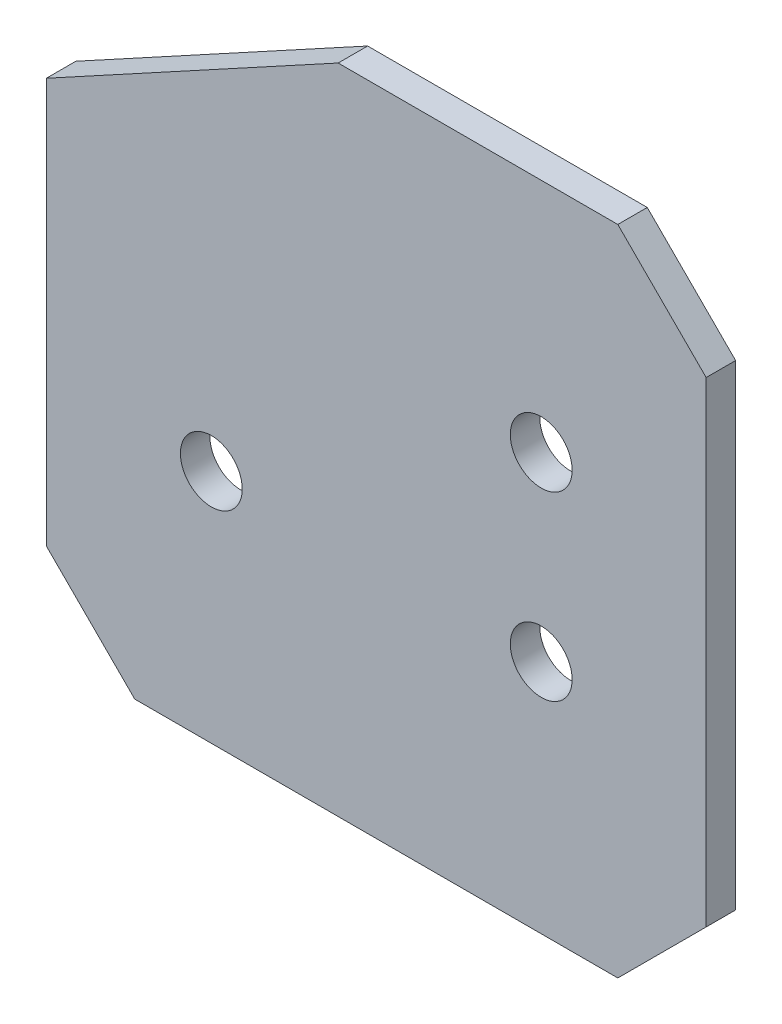
ISO-10303-21;
HEADER;
FILE_DESCRIPTION(('STEP AP214'),'2;1');
FILE_NAME('part.step','',(''),(''),'','','');
FILE_SCHEMA(('AUTOMOTIVE_DESIGN { 1 0 10303 214 1 1 1 1 }'));
ENDSEC;
DATA;
#1=APPLICATION_CONTEXT('core data for automotive mechanical design processes');
#2=APPLICATION_PROTOCOL_DEFINITION('international standard','automotive_design',2000,#1);
#3=PRODUCT_CONTEXT('',#1,'mechanical');
#4=PRODUCT('Part','Part','',(#3));
#5=PRODUCT_RELATED_PRODUCT_CATEGORY('part','',(#4));
#6=PRODUCT_DEFINITION_FORMATION('','',#4);
#7=PRODUCT_DEFINITION_CONTEXT('part definition',#1,'design');
#8=PRODUCT_DEFINITION('design','',#6,#7);
#9=PRODUCT_DEFINITION_SHAPE('','',#8);
#10=(LENGTH_UNIT() NAMED_UNIT(*) SI_UNIT(.MILLI.,.METRE.));
#11=(NAMED_UNIT(*) PLANE_ANGLE_UNIT() SI_UNIT($,.RADIAN.));
#12=(NAMED_UNIT(*) SI_UNIT($,.STERADIAN.) SOLID_ANGLE_UNIT());
#13=UNCERTAINTY_MEASURE_WITH_UNIT(LENGTH_MEASURE(1.E-05),#10,'distance_accuracy_value','');
#14=(GEOMETRIC_REPRESENTATION_CONTEXT(3) GLOBAL_UNCERTAINTY_ASSIGNED_CONTEXT((#13)) GLOBAL_UNIT_ASSIGNED_CONTEXT((#10,
#11,#12)) REPRESENTATION_CONTEXT('',''));
#15=CARTESIAN_POINT('',(0.,0.,0.));
#16=DIRECTION('',(0.,0.,1.));
#17=DIRECTION('',(1.,0.,0.));
#18=AXIS2_PLACEMENT_3D('',#15,#16,#17);
#19=CARTESIAN_POINT('',(55.9999999999994,3.00000000000045,-5.));
#20=DIRECTION('',(1.,0.,0.));
#21=DIRECTION('',(0.,1.,0.));
#22=AXIS2_PLACEMENT_3D('',#19,#20,#21);
#23=PLANE('',#22);
#24=DIRECTION('',(0.,1.,0.));
#25=VECTOR('',#24,1.);
#26=CARTESIAN_POINT('',(55.9999999999994,3.00000000000045,0.));
#27=LINE('',#26,#25);
#28=CARTESIAN_POINT('',(55.9999999999994,18.0000000000005,0.));
#29=VERTEX_POINT('',#28);
#30=CARTESIAN_POINT('',(55.9999999999987,98.7738106804795,0.));
#31=VERTEX_POINT('',#30);
#32=EDGE_CURVE('E118',#29,#31,#27,.T.);
#33=ORIENTED_EDGE('',*,*,#32,.F.);
#34=DIRECTION('',(0.,0.,-1.));
#35=VECTOR('',#34,1.);
#36=CARTESIAN_POINT('',(55.9999999999994,18.0000000000005,-5.));
#37=LINE('',#36,#35);
#38=CARTESIAN_POINT('',(55.9999999999994,18.0000000000005,-5.));
#39=VERTEX_POINT('',#38);
#40=EDGE_CURVE('E143',#29,#39,#37,.T.);
#41=ORIENTED_EDGE('',*,*,#40,.T.);
#42=DIRECTION('',(0.,1.,0.));
#43=VECTOR('',#42,1.);
#44=CARTESIAN_POINT('',(55.9999999999994,3.00000000000045,-5.));
#45=LINE('',#44,#43);
#46=CARTESIAN_POINT('',(55.9999999999987,98.7738106804795,-5.));
#47=VERTEX_POINT('',#46);
#48=EDGE_CURVE('E128',#39,#47,#45,.T.);
#49=ORIENTED_EDGE('',*,*,#48,.T.);
#50=DIRECTION('',(0.,0.,1.));
#51=VECTOR('',#50,1.);
#52=CARTESIAN_POINT('',(55.9999999999987,98.7738106804795,-5.));
#53=LINE('',#52,#51);
#54=EDGE_CURVE('E140',#47,#31,#53,.T.);
#55=ORIENTED_EDGE('',*,*,#54,.T.);
#56=EDGE_LOOP('',(#33,#41,#49,#55));
#57=FACE_BOUND('',#56,.T.);
#58=ADVANCED_FACE('F38',(#57),#23,.T.);
#59=CARTESIAN_POINT('',(55.9999999999994,3.00000000000045,-5.));
#60=DIRECTION('',(0.,-1.,0.));
#61=DIRECTION('',(1.,0.,0.));
#62=AXIS2_PLACEMENT_3D('',#59,#60,#61);
#63=PLANE('',#62);
#64=DIRECTION('',(1.,0.,0.));
#65=VECTOR('',#64,1.);
#66=CARTESIAN_POINT('',(55.9999999999994,3.00000000000045,-5.));
#67=LINE('',#66,#65);
#68=CARTESIAN_POINT('',(-40.9999999999995,3.00000000000007,-5.));
#69=VERTEX_POINT('',#68);
#70=CARTESIAN_POINT('',(40.9999999999995,3.00000000000038,-5.));
#71=VERTEX_POINT('',#70);
#72=EDGE_CURVE('E132',#69,#71,#67,.T.);
#73=ORIENTED_EDGE('',*,*,#72,.T.);
#74=DIRECTION('',(0.,0.,1.));
#75=VECTOR('',#74,1.);
#76=CARTESIAN_POINT('',(40.9999999999995,3.00000000000038,-5.));
#77=LINE('',#76,#75);
#78=CARTESIAN_POINT('',(40.9999999999995,3.00000000000038,0.));
#79=VERTEX_POINT('',#78);
#80=EDGE_CURVE('E131',#71,#79,#77,.T.);
#81=ORIENTED_EDGE('',*,*,#80,.T.);
#82=DIRECTION('',(1.,0.,0.));
#83=VECTOR('',#82,1.);
#84=CARTESIAN_POINT('',(55.9999999999994,3.00000000000045,0.));
#85=LINE('',#84,#83);
#86=CARTESIAN_POINT('',(-40.9999999999995,3.00000000000007,0.));
#87=VERTEX_POINT('',#86);
#88=EDGE_CURVE('E120',#87,#79,#85,.T.);
#89=ORIENTED_EDGE('',*,*,#88,.F.);
#90=DIRECTION('',(0.,0.,-1.));
#91=VECTOR('',#90,1.);
#92=CARTESIAN_POINT('',(-40.9999999999995,3.00000000000007,-5.));
#93=LINE('',#92,#91);
#94=EDGE_CURVE('E129',#87,#69,#93,.T.);
#95=ORIENTED_EDGE('',*,*,#94,.T.);
#96=EDGE_LOOP('',(#73,#81,#89,#95));
#97=FACE_BOUND('',#96,.T.);
#98=ADVANCED_FACE('F165',(#97),#63,.T.);
#99=CARTESIAN_POINT('',(-55.9999999999994,3.,-5.));
#100=DIRECTION('',(-1.,0.,0.));
#101=DIRECTION('',(0.,0.,1.));
#102=AXIS2_PLACEMENT_3D('',#99,#100,#101);
#103=PLANE('',#102);
#104=DIRECTION('',(0.,0.,1.));
#105=VECTOR('',#104,1.);
#106=CARTESIAN_POINT('',(-55.9999999999994,86.7684486211549,-10.));
#107=LINE('',#106,#105);
#108=CARTESIAN_POINT('',(-55.9999999999994,86.7684486211549,-5.));
#109=VERTEX_POINT('',#108);
#110=CARTESIAN_POINT('',(-55.9999999999994,86.7684486211549,0.));
#111=VERTEX_POINT('',#110);
#112=EDGE_CURVE('E53',#109,#111,#107,.T.);
#113=ORIENTED_EDGE('',*,*,#112,.F.);
#114=DIRECTION('',(0.,-1.,0.));
#115=VECTOR('',#114,1.);
#116=CARTESIAN_POINT('',(-55.9999999999994,3.,-5.));
#117=LINE('',#116,#115);
#118=CARTESIAN_POINT('',(-55.9999999999994,17.9999999999999,-5.));
#119=VERTEX_POINT('',#118);
#120=EDGE_CURVE('E156',#109,#119,#117,.T.);
#121=ORIENTED_EDGE('',*,*,#120,.T.);
#122=DIRECTION('',(0.,0.,1.));
#123=VECTOR('',#122,1.);
#124=CARTESIAN_POINT('',(-55.9999999999994,17.9999999999999,-5.));
#125=LINE('',#124,#123);
#126=CARTESIAN_POINT('',(-55.9999999999994,17.9999999999999,0.));
#127=VERTEX_POINT('',#126);
#128=EDGE_CURVE('E46',#119,#127,#125,.T.);
#129=ORIENTED_EDGE('',*,*,#128,.T.);
#130=DIRECTION('',(0.,-1.,0.));
#131=VECTOR('',#130,1.);
#132=CARTESIAN_POINT('',(-55.9999999999994,3.,0.));
#133=LINE('',#132,#131);
#134=EDGE_CURVE('E117',#111,#127,#133,.T.);
#135=ORIENTED_EDGE('',*,*,#134,.F.);
#136=EDGE_LOOP('',(#113,#121,#129,#135));
#137=FACE_BOUND('',#136,.T.);
#138=ADVANCED_FACE('F154',(#137),#103,.T.);
#139=CARTESIAN_POINT('',(-55.9999999999994,113.773810680479,-5.));
#140=DIRECTION('',(0.,1.,0.));
#141=DIRECTION('',(-1.,0.,0.));
#142=AXIS2_PLACEMENT_3D('',#139,#140,#141);
#143=PLANE('',#142);
#144=DIRECTION('',(0.,0.,1.));
#145=VECTOR('',#144,1.);
#146=CARTESIAN_POINT('',(-6.46850911170516,113.773810680479,-10.));
#147=LINE('',#146,#145);
#148=CARTESIAN_POINT('',(-6.46850911170516,113.773810680479,-5.));
#149=VERTEX_POINT('',#148);
#150=CARTESIAN_POINT('',(-6.46850911170516,113.773810680479,0.));
#151=VERTEX_POINT('',#150);
#152=EDGE_CURVE('E103',#149,#151,#147,.T.);
#153=ORIENTED_EDGE('',*,*,#152,.T.);
#154=DIRECTION('',(-1.,0.,0.));
#155=VECTOR('',#154,1.);
#156=CARTESIAN_POINT('',(-55.9999999999994,113.773810680479,0.));
#157=LINE('',#156,#155);
#158=CARTESIAN_POINT('',(40.9999999999986,113.77381068048,0.));
#159=VERTEX_POINT('',#158);
#160=EDGE_CURVE('E110',#159,#151,#157,.T.);
#161=ORIENTED_EDGE('',*,*,#160,.F.);
#162=DIRECTION('',(0.,0.,-1.));
#163=VECTOR('',#162,1.);
#164=CARTESIAN_POINT('',(40.9999999999986,113.77381068048,-5.));
#165=LINE('',#164,#163);
#166=CARTESIAN_POINT('',(40.9999999999986,113.77381068048,-5.));
#167=VERTEX_POINT('',#166);
#168=EDGE_CURVE('E11',#159,#167,#165,.T.);
#169=ORIENTED_EDGE('',*,*,#168,.T.);
#170=DIRECTION('',(-1.,0.,0.));
#171=VECTOR('',#170,1.);
#172=CARTESIAN_POINT('',(-55.9999999999994,113.773810680479,-5.));
#173=LINE('',#172,#171);
#174=EDGE_CURVE('E111',#167,#149,#173,.T.);
#175=ORIENTED_EDGE('',*,*,#174,.T.);
#176=EDGE_LOOP('',(#153,#161,#169,#175));
#177=FACE_BOUND('',#176,.T.);
#178=ADVANCED_FACE('F109',(#177),#143,.T.);
#179=CARTESIAN_POINT('',(0.,0.,-5.));
#180=DIRECTION('',(0.,0.,-1.));
#181=DIRECTION('',(-1.,0.,0.));
#182=AXIS2_PLACEMENT_3D('',#179,#180,#181);
#183=PLANE('',#182);
#184=DIRECTION('',(-0.877983597106914,-0.478690717699021,0.));
#185=VECTOR('',#184,1.);
#186=CARTESIAN_POINT('',(-49.2993780104589,90.421735037635,-5.));
#187=LINE('',#186,#185);
#188=EDGE_CURVE('E112',#149,#109,#187,.T.);
#189=ORIENTED_EDGE('',*,*,#188,.F.);
#190=ORIENTED_EDGE('',*,*,#174,.F.);
#191=DIRECTION('',(-0.707106781186552,0.707106781186543,0.));
#192=VECTOR('',#191,1.);
#193=CARTESIAN_POINT('',(77.3869053402388,77.3869053402398,-5.));
#194=LINE('',#193,#192);
#195=EDGE_CURVE('E145',#167,#47,#194,.F.);
#196=ORIENTED_EDGE('',*,*,#195,.T.);
#197=ORIENTED_EDGE('',*,*,#48,.F.);
#198=DIRECTION('',(0.707106781186542,0.707106781186553,0.));
#199=VECTOR('',#198,1.);
#200=CARTESIAN_POINT('',(18.9999999999999,-18.9999999999996,-5.));
#201=LINE('',#200,#199);
#202=EDGE_CURVE('E150',#39,#71,#201,.F.);
#203=ORIENTED_EDGE('',*,*,#202,.T.);
#204=ORIENTED_EDGE('',*,*,#72,.F.);
#205=DIRECTION('',(0.707106781186552,-0.707106781186543,0.));
#206=VECTOR('',#205,1.);
#207=CARTESIAN_POINT('',(-18.9999999999995,-18.9999999999997,-5.));
#208=LINE('',#207,#206);
#209=EDGE_CURVE('E147',#69,#119,#208,.F.);
#210=ORIENTED_EDGE('',*,*,#209,.T.);
#211=ORIENTED_EDGE('',*,*,#120,.F.);
#212=EDGE_LOOP('',(#189,#190,#196,#197,#203,#204,#210,#211));
#213=FACE_BOUND('',#212,.T.);
#214=CARTESIAN_POINT('',(27.9999999999996,43.,-5.));
#215=DIRECTION('',(0.,0.,1.));
#216=DIRECTION('',(-1.,0.,0.));
#217=AXIS2_PLACEMENT_3D('',#214,#215,#216);
#218=CIRCLE('',#217,5.25);
#219=CARTESIAN_POINT('',(22.7499999999996,43.,-5.));
#220=VERTEX_POINT('',#219);
#221=EDGE_CURVE('E195',#220,#220,#218,.T.);
#222=ORIENTED_EDGE('',*,*,#221,.T.);
#223=EDGE_LOOP('',(#222));
#224=FACE_BOUND('',#223,.T.);
#225=CARTESIAN_POINT('',(27.9999999999994,73.7738106804792,-5.));
#226=DIRECTION('',(0.,0.,1.));
#227=DIRECTION('',(-1.,0.,0.));
#228=AXIS2_PLACEMENT_3D('',#225,#226,#227);
#229=CIRCLE('',#228,5.25000000000001);
#230=CARTESIAN_POINT('',(22.7499999999993,73.7738106804792,-5.));
#231=VERTEX_POINT('',#230);
#232=EDGE_CURVE('E189',#231,#231,#229,.T.);
#233=ORIENTED_EDGE('',*,*,#232,.T.);
#234=EDGE_LOOP('',(#233));
#235=FACE_BOUND('',#234,.T.);
#236=CARTESIAN_POINT('',(-28.,43.,-5.));
#237=DIRECTION('',(0.,0.,1.));
#238=DIRECTION('',(1.,0.,0.));
#239=AXIS2_PLACEMENT_3D('',#236,#237,#238);
#240=CIRCLE('',#239,5.25);
#241=CARTESIAN_POINT('',(-22.75,43.,-5.));
#242=VERTEX_POINT('',#241);
#243=EDGE_CURVE('E122',#242,#242,#240,.T.);
#244=ORIENTED_EDGE('',*,*,#243,.T.);
#245=EDGE_LOOP('',(#244));
#246=FACE_BOUND('',#245,.T.);
#247=ADVANCED_FACE('F180',(#213,#224,#235,#246),#183,.T.);
#248=CARTESIAN_POINT('',(0.,0.,0.));
#249=DIRECTION('',(0.,0.,-1.));
#250=DIRECTION('',(-1.,0.,0.));
#251=AXIS2_PLACEMENT_3D('',#248,#249,#250);
#252=PLANE('',#251);
#253=CARTESIAN_POINT('',(27.9999999999996,43.,0.));
#254=DIRECTION('',(0.,0.,1.));
#255=DIRECTION('',(-1.,0.,0.));
#256=AXIS2_PLACEMENT_3D('',#253,#254,#255);
#257=CIRCLE('',#256,5.25);
#258=CARTESIAN_POINT('',(22.7499999999996,43.,0.));
#259=VERTEX_POINT('',#258);
#260=EDGE_CURVE('E198',#259,#259,#257,.T.);
#261=ORIENTED_EDGE('',*,*,#260,.F.);
#262=EDGE_LOOP('',(#261));
#263=FACE_BOUND('',#262,.T.);
#264=CARTESIAN_POINT('',(27.9999999999994,73.7738106804792,0.));
#265=DIRECTION('',(0.,0.,1.));
#266=DIRECTION('',(-1.,0.,0.));
#267=AXIS2_PLACEMENT_3D('',#264,#265,#266);
#268=CIRCLE('',#267,5.25000000000001);
#269=CARTESIAN_POINT('',(22.7499999999993,73.7738106804792,0.));
#270=VERTEX_POINT('',#269);
#271=EDGE_CURVE('E192',#270,#270,#268,.T.);
#272=ORIENTED_EDGE('',*,*,#271,.F.);
#273=EDGE_LOOP('',(#272));
#274=FACE_BOUND('',#273,.T.);
#275=CARTESIAN_POINT('',(-28.,43.,0.));
#276=DIRECTION('',(0.,0.,1.));
#277=DIRECTION('',(1.,0.,0.));
#278=AXIS2_PLACEMENT_3D('',#275,#276,#277);
#279=CIRCLE('',#278,5.25);
#280=CARTESIAN_POINT('',(-22.75,43.,0.));
#281=VERTEX_POINT('',#280);
#282=EDGE_CURVE('E186',#281,#281,#279,.T.);
#283=ORIENTED_EDGE('',*,*,#282,.F.);
#284=EDGE_LOOP('',(#283));
#285=FACE_BOUND('',#284,.T.);
#286=ORIENTED_EDGE('',*,*,#160,.T.);
#287=DIRECTION('',(0.877983597106914,0.478690717699021,0.));
#288=VECTOR('',#287,1.);
#289=CARTESIAN_POINT('',(-55.9999999999994,86.7684486211549,0.));
#290=LINE('',#289,#288);
#291=EDGE_CURVE('E100',#111,#151,#290,.T.);
#292=ORIENTED_EDGE('',*,*,#291,.F.);
#293=ORIENTED_EDGE('',*,*,#134,.T.);
#294=DIRECTION('',(-0.707106781186552,0.707106781186543,0.));
#295=VECTOR('',#294,1.);
#296=CARTESIAN_POINT('',(-55.9999999999994,17.9999999999999,0.));
#297=LINE('',#296,#295);
#298=EDGE_CURVE('E136',#127,#87,#297,.F.);
#299=ORIENTED_EDGE('',*,*,#298,.T.);
#300=ORIENTED_EDGE('',*,*,#88,.T.);
#301=DIRECTION('',(-0.707106781186542,-0.707106781186553,0.));
#302=VECTOR('',#301,1.);
#303=CARTESIAN_POINT('',(40.9999999999995,3.00000000000038,0.));
#304=LINE('',#303,#302);
#305=EDGE_CURVE('E138',#79,#29,#304,.F.);
#306=ORIENTED_EDGE('',*,*,#305,.T.);
#307=ORIENTED_EDGE('',*,*,#32,.T.);
#308=DIRECTION('',(0.707106781186552,-0.707106781186543,0.));
#309=VECTOR('',#308,1.);
#310=CARTESIAN_POINT('',(55.9999999999987,98.7738106804795,0.));
#311=LINE('',#310,#309);
#312=EDGE_CURVE('E116',#31,#159,#311,.F.);
#313=ORIENTED_EDGE('',*,*,#312,.T.);
#314=EDGE_LOOP('',(#286,#292,#293,#299,#300,#306,#307,#313));
#315=FACE_BOUND('',#314,.T.);
#316=ADVANCED_FACE('F114',(#263,#274,#285,#315),#252,.F.);
#317=CARTESIAN_POINT('',(-28.,43.,-5.));
#318=DIRECTION('',(0.,0.,1.));
#319=DIRECTION('',(1.,0.,0.));
#320=AXIS2_PLACEMENT_3D('',#317,#318,#319);
#321=CYLINDRICAL_SURFACE('',#320,5.25);
#322=ORIENTED_EDGE('',*,*,#243,.F.);
#323=EDGE_LOOP('',(#322));
#324=FACE_BOUND('',#323,.T.);
#325=ORIENTED_EDGE('',*,*,#282,.T.);
#326=EDGE_LOOP('',(#325));
#327=FACE_BOUND('',#326,.T.);
#328=ADVANCED_FACE('F216',(#324,#327),#321,.F.);
#329=CARTESIAN_POINT('',(27.9999999999994,73.7738106804792,-5.));
#330=DIRECTION('',(0.,0.,1.));
#331=DIRECTION('',(1.,0.,0.));
#332=AXIS2_PLACEMENT_3D('',#329,#330,#331);
#333=CYLINDRICAL_SURFACE('',#332,5.25000000000001);
#334=ORIENTED_EDGE('',*,*,#232,.F.);
#335=EDGE_LOOP('',(#334));
#336=FACE_BOUND('',#335,.T.);
#337=ORIENTED_EDGE('',*,*,#271,.T.);
#338=EDGE_LOOP('',(#337));
#339=FACE_BOUND('',#338,.T.);
#340=ADVANCED_FACE('F210',(#336,#339),#333,.F.);
#341=CARTESIAN_POINT('',(27.9999999999996,43.,-5.));
#342=DIRECTION('',(0.,0.,1.));
#343=DIRECTION('',(1.,0.,0.));
#344=AXIS2_PLACEMENT_3D('',#341,#342,#343);
#345=CYLINDRICAL_SURFACE('',#344,5.25);
#346=ORIENTED_EDGE('',*,*,#221,.F.);
#347=EDGE_LOOP('',(#346));
#348=FACE_BOUND('',#347,.T.);
#349=ORIENTED_EDGE('',*,*,#260,.T.);
#350=EDGE_LOOP('',(#349));
#351=FACE_BOUND('',#350,.T.);
#352=ADVANCED_FACE('F207',(#348,#351),#345,.F.);
#353=CARTESIAN_POINT('',(40.9999999999995,3.00000000000038,-5.));
#354=DIRECTION('',(-0.707106781186553,0.707106781186542,0.));
#355=DIRECTION('',(0.,0.,1.));
#356=AXIS2_PLACEMENT_3D('',#353,#354,#355);
#357=PLANE('',#356);
#358=ORIENTED_EDGE('',*,*,#202,.F.);
#359=ORIENTED_EDGE('',*,*,#40,.F.);
#360=ORIENTED_EDGE('',*,*,#305,.F.);
#361=ORIENTED_EDGE('',*,*,#80,.F.);
#362=EDGE_LOOP('',(#358,#359,#360,#361));
#363=FACE_BOUND('',#362,.T.);
#364=ADVANCED_FACE('F170',(#363),#357,.F.);
#365=CARTESIAN_POINT('',(-55.9999999999994,17.9999999999999,-5.));
#366=DIRECTION('',(0.707106781186543,0.707106781186552,0.));
#367=DIRECTION('',(0.,0.,1.));
#368=AXIS2_PLACEMENT_3D('',#365,#366,#367);
#369=PLANE('',#368);
#370=ORIENTED_EDGE('',*,*,#209,.F.);
#371=ORIENTED_EDGE('',*,*,#94,.F.);
#372=ORIENTED_EDGE('',*,*,#298,.F.);
#373=ORIENTED_EDGE('',*,*,#128,.F.);
#374=EDGE_LOOP('',(#370,#371,#372,#373));
#375=FACE_BOUND('',#374,.T.);
#376=ADVANCED_FACE('F160',(#375),#369,.F.);
#377=CARTESIAN_POINT('',(55.9999999999987,98.7738106804795,-5.));
#378=DIRECTION('',(-0.707106781186543,-0.707106781186552,0.));
#379=DIRECTION('',(0.,0.,1.));
#380=AXIS2_PLACEMENT_3D('',#377,#378,#379);
#381=PLANE('',#380);
#382=ORIENTED_EDGE('',*,*,#195,.F.);
#383=ORIENTED_EDGE('',*,*,#168,.F.);
#384=ORIENTED_EDGE('',*,*,#312,.F.);
#385=ORIENTED_EDGE('',*,*,#54,.F.);
#386=EDGE_LOOP('',(#382,#383,#384,#385));
#387=FACE_BOUND('',#386,.T.);
#388=ADVANCED_FACE('F40',(#387),#381,.F.);
#389=CARTESIAN_POINT('',(-55.9999999999994,86.7684486211549,-10.));
#390=DIRECTION('',(0.478690717699021,-0.877983597106914,0.));
#391=DIRECTION('',(0.877983597106914,0.478690717699021,0.));
#392=AXIS2_PLACEMENT_3D('',#389,#390,#391);
#393=PLANE('',#392);
#394=ORIENTED_EDGE('',*,*,#188,.T.);
#395=ORIENTED_EDGE('',*,*,#112,.T.);
#396=ORIENTED_EDGE('',*,*,#291,.T.);
#397=ORIENTED_EDGE('',*,*,#152,.F.);
#398=EDGE_LOOP('',(#394,#395,#396,#397));
#399=FACE_BOUND('',#398,.T.);
#400=ADVANCED_FACE('F102',(#399),#393,.F.);
#401=CLOSED_SHELL('',(#58,#98,#138,#178,#247,#316,#328,#340,#352,#364,#376,#388,#400));
#402=MANIFOLD_SOLID_BREP('B2',#401);
#403=ADVANCED_BREP_SHAPE_REPRESENTATION('',(#18,#402),#14);
#404=SHAPE_DEFINITION_REPRESENTATION(#9,#403);
ENDSEC;
END-ISO-10303-21;
